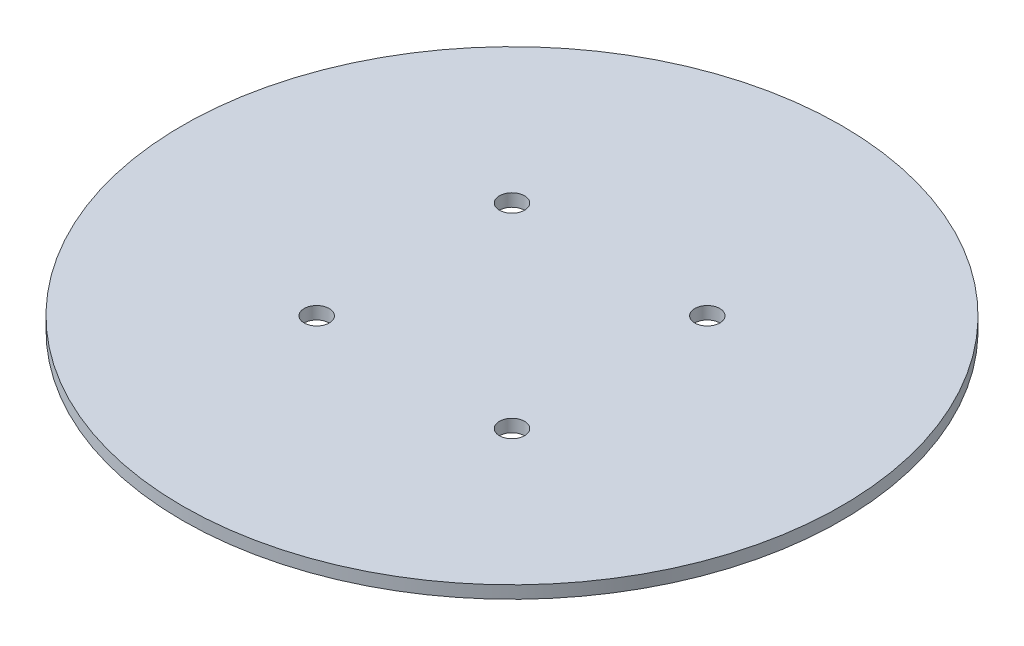
ISO-10303-21;
HEADER;
FILE_DESCRIPTION(('STEP AP214'),'2;1');
FILE_NAME('part.step','',(''),(''),'','','');
FILE_SCHEMA(('AUTOMOTIVE_DESIGN { 1 0 10303 214 1 1 1 1 }'));
ENDSEC;
DATA;
#1=APPLICATION_CONTEXT('core data for automotive mechanical design processes');
#2=APPLICATION_PROTOCOL_DEFINITION('international standard','automotive_design',2000,#1);
#3=PRODUCT_CONTEXT('',#1,'mechanical');
#4=PRODUCT('Part','Part','',(#3));
#5=PRODUCT_RELATED_PRODUCT_CATEGORY('part','',(#4));
#6=PRODUCT_DEFINITION_FORMATION('','',#4);
#7=PRODUCT_DEFINITION_CONTEXT('part definition',#1,'design');
#8=PRODUCT_DEFINITION('design','',#6,#7);
#9=PRODUCT_DEFINITION_SHAPE('','',#8);
#10=(LENGTH_UNIT() NAMED_UNIT(*) SI_UNIT(.MILLI.,.METRE.));
#11=(NAMED_UNIT(*) PLANE_ANGLE_UNIT() SI_UNIT($,.RADIAN.));
#12=(NAMED_UNIT(*) SI_UNIT($,.STERADIAN.) SOLID_ANGLE_UNIT());
#13=UNCERTAINTY_MEASURE_WITH_UNIT(LENGTH_MEASURE(1.E-05),#10,'distance_accuracy_value','');
#14=(GEOMETRIC_REPRESENTATION_CONTEXT(3) GLOBAL_UNCERTAINTY_ASSIGNED_CONTEXT((#13)) GLOBAL_UNIT_ASSIGNED_CONTEXT((#10,
#11,#12)) REPRESENTATION_CONTEXT('',''));
#15=CARTESIAN_POINT('',(0.,0.,0.));
#16=DIRECTION('',(0.,0.,1.));
#17=DIRECTION('',(1.,0.,0.));
#18=AXIS2_PLACEMENT_3D('',#15,#16,#17);
#19=CARTESIAN_POINT('',(0.,4.,0.));
#20=DIRECTION('',(0.,-1.,0.));
#21=DIRECTION('',(0.,0.,-1.));
#22=AXIS2_PLACEMENT_3D('',#19,#20,#21);
#23=CYLINDRICAL_SURFACE('',#22,105.);
#24=CARTESIAN_POINT('',(0.,4.,0.));
#25=DIRECTION('',(0.,1.,0.));
#26=DIRECTION('',(0.,0.,1.));
#27=AXIS2_PLACEMENT_3D('',#24,#25,#26);
#28=CIRCLE('',#27,105.);
#29=CARTESIAN_POINT('',(0.,4.,105.));
#30=VERTEX_POINT('',#29);
#31=EDGE_CURVE('E10',#30,#30,#28,.T.);
#32=ORIENTED_EDGE('',*,*,#31,.F.);
#33=EDGE_LOOP('',(#32));
#34=FACE_BOUND('',#33,.T.);
#35=CARTESIAN_POINT('',(0.,0.,0.));
#36=DIRECTION('',(0.,1.,0.));
#37=DIRECTION('',(0.,0.,1.));
#38=AXIS2_PLACEMENT_3D('',#35,#36,#37);
#39=CIRCLE('',#38,105.);
#40=CARTESIAN_POINT('',(0.,0.,105.));
#41=VERTEX_POINT('',#40);
#42=EDGE_CURVE('E38',#41,#41,#39,.T.);
#43=ORIENTED_EDGE('',*,*,#42,.T.);
#44=EDGE_LOOP('',(#43));
#45=FACE_BOUND('',#44,.T.);
#46=ADVANCED_FACE('F31',(#34,#45),#23,.T.);
#47=CARTESIAN_POINT('',(0.,4.,0.));
#48=DIRECTION('',(0.,1.,0.));
#49=DIRECTION('',(0.,0.,1.));
#50=AXIS2_PLACEMENT_3D('',#47,#48,#49);
#51=PLANE('',#50);
#52=CARTESIAN_POINT('',(-31.112698372208,4.,31.1126983722082));
#53=DIRECTION('',(0.,1.,0.));
#54=DIRECTION('',(0.,0.,1.));
#55=AXIS2_PLACEMENT_3D('',#52,#53,#54);
#56=CIRCLE('',#55,4.);
#57=CARTESIAN_POINT('',(-31.112698372208,4.,35.1126983722082));
#58=VERTEX_POINT('',#57);
#59=EDGE_CURVE('E109',#58,#58,#56,.T.);
#60=ORIENTED_EDGE('',*,*,#59,.F.);
#61=EDGE_LOOP('',(#60));
#62=FACE_BOUND('',#61,.T.);
#63=CARTESIAN_POINT('',(-31.112698372208,4.,-31.1126983722081));
#64=DIRECTION('',(0.,1.,0.));
#65=DIRECTION('',(0.,0.,1.));
#66=AXIS2_PLACEMENT_3D('',#63,#64,#65);
#67=CIRCLE('',#66,4.);
#68=CARTESIAN_POINT('',(-31.112698372208,4.,-27.1126983722081));
#69=VERTEX_POINT('',#68);
#70=EDGE_CURVE('E105',#69,#69,#67,.T.);
#71=ORIENTED_EDGE('',*,*,#70,.F.);
#72=EDGE_LOOP('',(#71));
#73=FACE_BOUND('',#72,.T.);
#74=CARTESIAN_POINT('',(31.1126983722081,4.,-31.1126983722081));
#75=DIRECTION('',(0.,1.,0.));
#76=DIRECTION('',(0.,0.,1.));
#77=AXIS2_PLACEMENT_3D('',#74,#75,#76);
#78=CIRCLE('',#77,4.00000000000001);
#79=CARTESIAN_POINT('',(31.1126983722081,4.,-27.1126983722081));
#80=VERTEX_POINT('',#79);
#81=EDGE_CURVE('E103',#80,#80,#78,.T.);
#82=ORIENTED_EDGE('',*,*,#81,.F.);
#83=EDGE_LOOP('',(#82));
#84=FACE_BOUND('',#83,.T.);
#85=CARTESIAN_POINT('',(31.112698372208,4.,31.1126983722081));
#86=DIRECTION('',(0.,1.,0.));
#87=DIRECTION('',(0.,0.,1.));
#88=AXIS2_PLACEMENT_3D('',#85,#86,#87);
#89=CIRCLE('',#88,4.);
#90=CARTESIAN_POINT('',(31.112698372208,4.,35.1126983722081));
#91=VERTEX_POINT('',#90);
#92=EDGE_CURVE('E45',#91,#91,#89,.T.);
#93=ORIENTED_EDGE('',*,*,#92,.F.);
#94=EDGE_LOOP('',(#93));
#95=FACE_BOUND('',#94,.T.);
#96=ORIENTED_EDGE('',*,*,#31,.T.);
#97=EDGE_LOOP('',(#96));
#98=FACE_BOUND('',#97,.T.);
#99=ADVANCED_FACE('F76',(#62,#73,#84,#95,#98),#51,.T.);
#100=CARTESIAN_POINT('',(0.,0.,0.));
#101=DIRECTION('',(0.,1.,0.));
#102=DIRECTION('',(0.,0.,1.));
#103=AXIS2_PLACEMENT_3D('',#100,#101,#102);
#104=PLANE('',#103);
#105=CARTESIAN_POINT('',(-31.112698372208,0.,31.1126983722082));
#106=DIRECTION('',(0.,1.,0.));
#107=DIRECTION('',(0.,0.,1.));
#108=AXIS2_PLACEMENT_3D('',#105,#106,#107);
#109=CIRCLE('',#108,4.);
#110=CARTESIAN_POINT('',(-31.112698372208,0.,35.1126983722082));
#111=VERTEX_POINT('',#110);
#112=EDGE_CURVE('E34',#111,#111,#109,.T.);
#113=ORIENTED_EDGE('',*,*,#112,.T.);
#114=EDGE_LOOP('',(#113));
#115=FACE_BOUND('',#114,.T.);
#116=CARTESIAN_POINT('',(-31.112698372208,0.,-31.1126983722081));
#117=DIRECTION('',(0.,1.,0.));
#118=DIRECTION('',(0.,0.,1.));
#119=AXIS2_PLACEMENT_3D('',#116,#117,#118);
#120=CIRCLE('',#119,4.);
#121=CARTESIAN_POINT('',(-31.112698372208,0.,-27.1126983722081));
#122=VERTEX_POINT('',#121);
#123=EDGE_CURVE('E53',#122,#122,#120,.T.);
#124=ORIENTED_EDGE('',*,*,#123,.T.);
#125=EDGE_LOOP('',(#124));
#126=FACE_BOUND('',#125,.T.);
#127=CARTESIAN_POINT('',(31.1126983722081,0.,-31.1126983722081));
#128=DIRECTION('',(0.,1.,0.));
#129=DIRECTION('',(0.,0.,1.));
#130=AXIS2_PLACEMENT_3D('',#127,#128,#129);
#131=CIRCLE('',#130,4.00000000000001);
#132=CARTESIAN_POINT('',(31.1126983722081,0.,-27.1126983722081));
#133=VERTEX_POINT('',#132);
#134=EDGE_CURVE('E51',#133,#133,#131,.T.);
#135=ORIENTED_EDGE('',*,*,#134,.T.);
#136=EDGE_LOOP('',(#135));
#137=FACE_BOUND('',#136,.T.);
#138=CARTESIAN_POINT('',(31.112698372208,0.,31.1126983722081));
#139=DIRECTION('',(0.,1.,0.));
#140=DIRECTION('',(0.,0.,1.));
#141=AXIS2_PLACEMENT_3D('',#138,#139,#140);
#142=CIRCLE('',#141,4.);
#143=CARTESIAN_POINT('',(31.112698372208,0.,35.1126983722081));
#144=VERTEX_POINT('',#143);
#145=EDGE_CURVE('E48',#144,#144,#142,.T.);
#146=ORIENTED_EDGE('',*,*,#145,.T.);
#147=EDGE_LOOP('',(#146));
#148=FACE_BOUND('',#147,.T.);
#149=ORIENTED_EDGE('',*,*,#42,.F.);
#150=EDGE_LOOP('',(#149));
#151=FACE_BOUND('',#150,.T.);
#152=ADVANCED_FACE('F60',(#115,#126,#137,#148,#151),#104,.F.);
#153=CARTESIAN_POINT('',(31.112698372208,-6.,31.1126983722081));
#154=DIRECTION('',(0.,1.,0.));
#155=DIRECTION('',(0.,0.,1.));
#156=AXIS2_PLACEMENT_3D('',#153,#154,#155);
#157=CYLINDRICAL_SURFACE('',#156,4.);
#158=ORIENTED_EDGE('',*,*,#92,.T.);
#159=EDGE_LOOP('',(#158));
#160=FACE_BOUND('',#159,.T.);
#161=ORIENTED_EDGE('',*,*,#145,.F.);
#162=EDGE_LOOP('',(#161));
#163=FACE_BOUND('',#162,.T.);
#164=ADVANCED_FACE('F87',(#160,#163),#157,.F.);
#165=CARTESIAN_POINT('',(31.1126983722081,-6.,-31.1126983722081));
#166=DIRECTION('',(0.,1.,0.));
#167=DIRECTION('',(0.,0.,1.));
#168=AXIS2_PLACEMENT_3D('',#165,#166,#167);
#169=CYLINDRICAL_SURFACE('',#168,4.00000000000001);
#170=ORIENTED_EDGE('',*,*,#81,.T.);
#171=EDGE_LOOP('',(#170));
#172=FACE_BOUND('',#171,.T.);
#173=ORIENTED_EDGE('',*,*,#134,.F.);
#174=EDGE_LOOP('',(#173));
#175=FACE_BOUND('',#174,.T.);
#176=ADVANCED_FACE('F70',(#172,#175),#169,.F.);
#177=CARTESIAN_POINT('',(-31.112698372208,-6.,-31.1126983722081));
#178=DIRECTION('',(0.,1.,0.));
#179=DIRECTION('',(0.,0.,1.));
#180=AXIS2_PLACEMENT_3D('',#177,#178,#179);
#181=CYLINDRICAL_SURFACE('',#180,4.);
#182=ORIENTED_EDGE('',*,*,#70,.T.);
#183=EDGE_LOOP('',(#182));
#184=FACE_BOUND('',#183,.T.);
#185=ORIENTED_EDGE('',*,*,#123,.F.);
#186=EDGE_LOOP('',(#185));
#187=FACE_BOUND('',#186,.T.);
#188=ADVANCED_FACE('F64',(#184,#187),#181,.F.);
#189=CARTESIAN_POINT('',(-31.112698372208,-6.,31.1126983722082));
#190=DIRECTION('',(0.,1.,0.));
#191=DIRECTION('',(0.,0.,1.));
#192=AXIS2_PLACEMENT_3D('',#189,#190,#191);
#193=CYLINDRICAL_SURFACE('',#192,4.);
#194=ORIENTED_EDGE('',*,*,#59,.T.);
#195=EDGE_LOOP('',(#194));
#196=FACE_BOUND('',#195,.T.);
#197=ORIENTED_EDGE('',*,*,#112,.F.);
#198=EDGE_LOOP('',(#197));
#199=FACE_BOUND('',#198,.T.);
#200=ADVANCED_FACE('F62',(#196,#199),#193,.F.);
#201=CLOSED_SHELL('',(#46,#99,#152,#164,#176,#188,#200));
#202=MANIFOLD_SOLID_BREP('B2',#201);
#203=ADVANCED_BREP_SHAPE_REPRESENTATION('',(#18,#202),#14);
#204=SHAPE_DEFINITION_REPRESENTATION(#9,#203);
ENDSEC;
END-ISO-10303-21;
